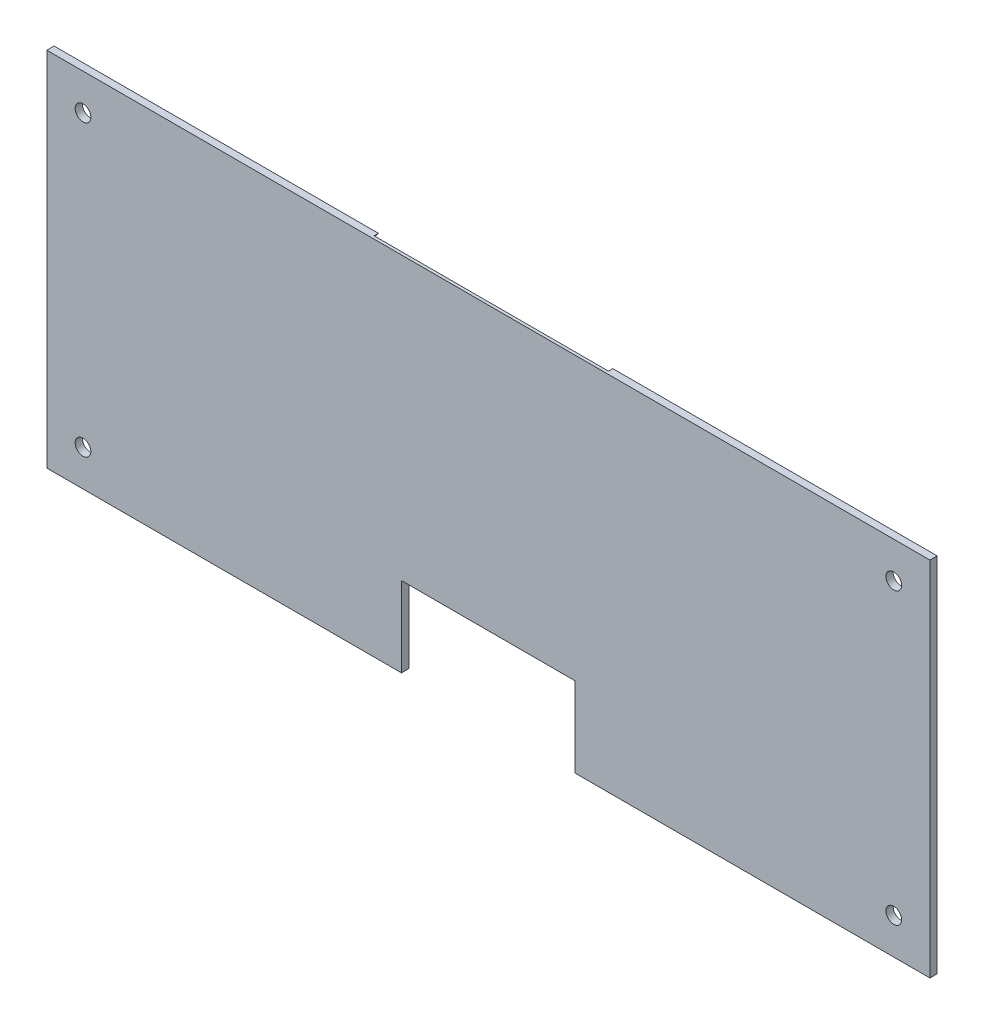
ISO-10303-21;
HEADER;
FILE_DESCRIPTION(('STEP AP214'),'2;1');
FILE_NAME('part.step','',(''),(''),'','','');
FILE_SCHEMA(('AUTOMOTIVE_DESIGN { 1 0 10303 214 1 1 1 1 }'));
ENDSEC;
DATA;
#1=APPLICATION_CONTEXT('core data for automotive mechanical design processes');
#2=APPLICATION_PROTOCOL_DEFINITION('international standard','automotive_design',2000,#1);
#3=PRODUCT_CONTEXT('',#1,'mechanical');
#4=PRODUCT('Part','Part','',(#3));
#5=PRODUCT_RELATED_PRODUCT_CATEGORY('part','',(#4));
#6=PRODUCT_DEFINITION_FORMATION('','',#4);
#7=PRODUCT_DEFINITION_CONTEXT('part definition',#1,'design');
#8=PRODUCT_DEFINITION('design','',#6,#7);
#9=PRODUCT_DEFINITION_SHAPE('','',#8);
#10=(LENGTH_UNIT() NAMED_UNIT(*) SI_UNIT(.MILLI.,.METRE.));
#11=(NAMED_UNIT(*) PLANE_ANGLE_UNIT() SI_UNIT($,.RADIAN.));
#12=(NAMED_UNIT(*) SI_UNIT($,.STERADIAN.) SOLID_ANGLE_UNIT());
#13=UNCERTAINTY_MEASURE_WITH_UNIT(LENGTH_MEASURE(1.E-05),#10,'distance_accuracy_value','');
#14=(GEOMETRIC_REPRESENTATION_CONTEXT(3) GLOBAL_UNCERTAINTY_ASSIGNED_CONTEXT((#13)) GLOBAL_UNIT_ASSIGNED_CONTEXT((#10,
#11,#12)) REPRESENTATION_CONTEXT('',''));
#15=CARTESIAN_POINT('',(0.,0.,0.));
#16=DIRECTION('',(0.,0.,1.));
#17=DIRECTION('',(1.,0.,0.));
#18=AXIS2_PLACEMENT_3D('',#15,#16,#17);
#19=CARTESIAN_POINT('',(0.,0.,3.175));
#20=DIRECTION('',(0.,0.,1.));
#21=DIRECTION('',(1.,0.,0.));
#22=AXIS2_PLACEMENT_3D('',#19,#20,#21);
#23=PLANE('',#22);
#24=CARTESIAN_POINT('',(177.8,-63.5,3.175));
#25=DIRECTION('',(0.,0.,1.));
#26=DIRECTION('',(1.,0.,0.));
#27=AXIS2_PLACEMENT_3D('',#24,#25,#26);
#28=CIRCLE('',#27,3.429);
#29=CARTESIAN_POINT('',(181.229,-63.5,3.175));
#30=VERTEX_POINT('',#29);
#31=EDGE_CURVE('E201',#30,#30,#28,.T.);
#32=ORIENTED_EDGE('',*,*,#31,.F.);
#33=EDGE_LOOP('',(#32));
#34=FACE_BOUND('',#33,.T.);
#35=CARTESIAN_POINT('',(-177.8,63.5,3.175));
#36=DIRECTION('',(0.,0.,1.));
#37=DIRECTION('',(1.,0.,0.));
#38=AXIS2_PLACEMENT_3D('',#35,#36,#37);
#39=CIRCLE('',#38,3.429);
#40=CARTESIAN_POINT('',(-174.371,63.5,3.175));
#41=VERTEX_POINT('',#40);
#42=EDGE_CURVE('E145',#41,#41,#39,.T.);
#43=ORIENTED_EDGE('',*,*,#42,.F.);
#44=EDGE_LOOP('',(#43));
#45=FACE_BOUND('',#44,.T.);
#46=DIRECTION('',(0.,-1.,0.));
#47=VECTOR('',#46,1.);
#48=CARTESIAN_POINT('',(-193.675,79.375,3.175));
#49=LINE('',#48,#47);
#50=CARTESIAN_POINT('',(-193.675,79.375,3.175));
#51=VERTEX_POINT('',#50);
#52=CARTESIAN_POINT('',(-193.675,-79.375,3.175));
#53=VERTEX_POINT('',#52);
#54=EDGE_CURVE('E159',#51,#53,#49,.T.);
#55=ORIENTED_EDGE('',*,*,#54,.T.);
#56=DIRECTION('',(1.,0.,0.));
#57=VECTOR('',#56,1.);
#58=CARTESIAN_POINT('',(-193.675,-79.375,3.175));
#59=LINE('',#58,#57);
#60=CARTESIAN_POINT('',(-38.1,-79.375,3.175));
#61=VERTEX_POINT('',#60);
#62=EDGE_CURVE('E97',#53,#61,#59,.T.);
#63=ORIENTED_EDGE('',*,*,#62,.T.);
#64=DIRECTION('',(0.,1.,0.));
#65=VECTOR('',#64,1.);
#66=CARTESIAN_POINT('',(-38.1,-79.375,3.175));
#67=LINE('',#66,#65);
#68=CARTESIAN_POINT('',(-38.1,-44.323,3.175));
#69=VERTEX_POINT('',#68);
#70=EDGE_CURVE('E219',#61,#69,#67,.T.);
#71=ORIENTED_EDGE('',*,*,#70,.T.);
#72=DIRECTION('',(1.,0.,0.));
#73=VECTOR('',#72,1.);
#74=CARTESIAN_POINT('',(-38.1,-44.323,3.175));
#75=LINE('',#74,#73);
#76=CARTESIAN_POINT('',(38.1,-44.323,3.175));
#77=VERTEX_POINT('',#76);
#78=EDGE_CURVE('E221',#69,#77,#75,.T.);
#79=ORIENTED_EDGE('',*,*,#78,.T.);
#80=DIRECTION('',(0.,-1.,0.));
#81=VECTOR('',#80,1.);
#82=CARTESIAN_POINT('',(38.1,-79.375,3.175));
#83=LINE('',#82,#81);
#84=CARTESIAN_POINT('',(38.1,-79.375,3.175));
#85=VERTEX_POINT('',#84);
#86=EDGE_CURVE('E119',#77,#85,#83,.T.);
#87=ORIENTED_EDGE('',*,*,#86,.T.);
#88=DIRECTION('',(1.,0.,0.));
#89=VECTOR('',#88,1.);
#90=CARTESIAN_POINT('',(38.1,-79.375,3.175));
#91=LINE('',#90,#89);
#92=CARTESIAN_POINT('',(193.675,-79.375,3.175));
#93=VERTEX_POINT('',#92);
#94=EDGE_CURVE('E112',#85,#93,#91,.T.);
#95=ORIENTED_EDGE('',*,*,#94,.T.);
#96=DIRECTION('',(0.,1.,0.));
#97=VECTOR('',#96,1.);
#98=CARTESIAN_POINT('',(193.675,79.375,3.175));
#99=LINE('',#98,#97);
#100=CARTESIAN_POINT('',(193.675,79.375,3.175));
#101=VERTEX_POINT('',#100);
#102=EDGE_CURVE('E116',#93,#101,#99,.T.);
#103=ORIENTED_EDGE('',*,*,#102,.T.);
#104=DIRECTION('',(-1.,0.,0.));
#105=VECTOR('',#104,1.);
#106=CARTESIAN_POINT('',(-193.675,79.375,3.175));
#107=LINE('',#106,#105);
#108=EDGE_CURVE('E56',#101,#51,#107,.T.);
#109=ORIENTED_EDGE('',*,*,#108,.T.);
#110=EDGE_LOOP('',(#55,#63,#71,#79,#87,#95,#103,#109));
#111=FACE_BOUND('',#110,.T.);
#112=CARTESIAN_POINT('',(177.8,63.5,3.175));
#113=DIRECTION('',(0.,0.,1.));
#114=DIRECTION('',(-1.,0.,0.));
#115=AXIS2_PLACEMENT_3D('',#112,#113,#114);
#116=CIRCLE('',#115,3.429);
#117=CARTESIAN_POINT('',(174.371,63.5,3.175));
#118=VERTEX_POINT('',#117);
#119=EDGE_CURVE('E207',#118,#118,#116,.T.);
#120=ORIENTED_EDGE('',*,*,#119,.F.);
#121=EDGE_LOOP('',(#120));
#122=FACE_BOUND('',#121,.T.);
#123=CARTESIAN_POINT('',(-177.8,-63.5,3.175));
#124=DIRECTION('',(0.,0.,1.));
#125=DIRECTION('',(-1.,0.,0.));
#126=AXIS2_PLACEMENT_3D('',#123,#124,#125);
#127=CIRCLE('',#126,3.429);
#128=CARTESIAN_POINT('',(-181.229,-63.5,3.175));
#129=VERTEX_POINT('',#128);
#130=EDGE_CURVE('E195',#129,#129,#127,.T.);
#131=ORIENTED_EDGE('',*,*,#130,.F.);
#132=EDGE_LOOP('',(#131));
#133=FACE_BOUND('',#132,.T.);
#134=ADVANCED_FACE('F33',(#34,#45,#111,#122,#133),#23,.T.);
#135=CARTESIAN_POINT('',(0.,0.,0.));
#136=DIRECTION('',(0.,0.,1.));
#137=DIRECTION('',(1.,0.,0.));
#138=AXIS2_PLACEMENT_3D('',#135,#136,#137);
#139=PLANE('',#138);
#140=CARTESIAN_POINT('',(177.8,-63.5,0.));
#141=DIRECTION('',(0.,0.,1.));
#142=DIRECTION('',(1.,0.,0.));
#143=AXIS2_PLACEMENT_3D('',#140,#141,#142);
#144=CIRCLE('',#143,3.429);
#145=CARTESIAN_POINT('',(181.229,-63.5,0.));
#146=VERTEX_POINT('',#145);
#147=EDGE_CURVE('E198',#146,#146,#144,.T.);
#148=ORIENTED_EDGE('',*,*,#147,.T.);
#149=EDGE_LOOP('',(#148));
#150=FACE_BOUND('',#149,.T.);
#151=CARTESIAN_POINT('',(-177.8,63.5,0.));
#152=DIRECTION('',(0.,0.,1.));
#153=DIRECTION('',(1.,0.,0.));
#154=AXIS2_PLACEMENT_3D('',#151,#152,#153);
#155=CIRCLE('',#154,3.429);
#156=CARTESIAN_POINT('',(-174.371,63.5,0.));
#157=VERTEX_POINT('',#156);
#158=EDGE_CURVE('E210',#157,#157,#155,.T.);
#159=ORIENTED_EDGE('',*,*,#158,.T.);
#160=EDGE_LOOP('',(#159));
#161=FACE_BOUND('',#160,.T.);
#162=DIRECTION('',(-1.,0.,0.));
#163=VECTOR('',#162,1.);
#164=CARTESIAN_POINT('',(-193.675,79.375,0.));
#165=LINE('',#164,#163);
#166=CARTESIAN_POINT('',(-51.3879414357104,79.375,0.));
#167=VERTEX_POINT('',#166);
#168=CARTESIAN_POINT('',(-193.675,79.375,0.));
#169=VERTEX_POINT('',#168);
#170=EDGE_CURVE('E88',#167,#169,#165,.T.);
#171=ORIENTED_EDGE('',*,*,#170,.F.);
#172=CARTESIAN_POINT('',(0.,34.925,0.));
#173=DIRECTION('',(0.,0.,-1.));
#174=DIRECTION('',(-1.,0.,0.));
#175=AXIS2_PLACEMENT_3D('',#172,#173,#174);
#176=CIRCLE('',#175,67.945);
#177=CARTESIAN_POINT('',(51.3879414357104,79.375,0.));
#178=VERTEX_POINT('',#177);
#179=EDGE_CURVE('E186',#178,#167,#176,.T.);
#180=ORIENTED_EDGE('',*,*,#179,.F.);
#181=CARTESIAN_POINT('',(193.675,79.375,0.));
#182=VERTEX_POINT('',#181);
#183=EDGE_CURVE('E156',#182,#178,#165,.T.);
#184=ORIENTED_EDGE('',*,*,#183,.F.);
#185=DIRECTION('',(0.,1.,0.));
#186=VECTOR('',#185,1.);
#187=CARTESIAN_POINT('',(193.675,79.375,0.));
#188=LINE('',#187,#186);
#189=CARTESIAN_POINT('',(193.675,-79.375,0.));
#190=VERTEX_POINT('',#189);
#191=EDGE_CURVE('E154',#190,#182,#188,.T.);
#192=ORIENTED_EDGE('',*,*,#191,.F.);
#193=DIRECTION('',(1.,0.,0.));
#194=VECTOR('',#193,1.);
#195=CARTESIAN_POINT('',(38.1,-79.375,0.));
#196=LINE('',#195,#194);
#197=CARTESIAN_POINT('',(38.1,-79.375,0.));
#198=VERTEX_POINT('',#197);
#199=EDGE_CURVE('E128',#198,#190,#196,.T.);
#200=ORIENTED_EDGE('',*,*,#199,.F.);
#201=DIRECTION('',(0.,-1.,0.));
#202=VECTOR('',#201,1.);
#203=CARTESIAN_POINT('',(38.1,-79.375,0.));
#204=LINE('',#203,#202);
#205=CARTESIAN_POINT('',(38.1,-44.323,0.));
#206=VERTEX_POINT('',#205);
#207=EDGE_CURVE('E151',#206,#198,#204,.T.);
#208=ORIENTED_EDGE('',*,*,#207,.F.);
#209=DIRECTION('',(1.,0.,0.));
#210=VECTOR('',#209,1.);
#211=CARTESIAN_POINT('',(-38.1,-44.323,0.));
#212=LINE('',#211,#210);
#213=CARTESIAN_POINT('',(-38.1,-44.323,0.));
#214=VERTEX_POINT('',#213);
#215=EDGE_CURVE('E149',#214,#206,#212,.T.);
#216=ORIENTED_EDGE('',*,*,#215,.F.);
#217=DIRECTION('',(0.,1.,0.));
#218=VECTOR('',#217,1.);
#219=CARTESIAN_POINT('',(-38.1,-79.375,0.));
#220=LINE('',#219,#218);
#221=CARTESIAN_POINT('',(-38.1,-79.375,0.));
#222=VERTEX_POINT('',#221);
#223=EDGE_CURVE('E147',#222,#214,#220,.T.);
#224=ORIENTED_EDGE('',*,*,#223,.F.);
#225=DIRECTION('',(1.,0.,0.));
#226=VECTOR('',#225,1.);
#227=CARTESIAN_POINT('',(-193.675,-79.375,0.));
#228=LINE('',#227,#226);
#229=CARTESIAN_POINT('',(-193.675,-79.375,0.));
#230=VERTEX_POINT('',#229);
#231=EDGE_CURVE('E144',#230,#222,#228,.T.);
#232=ORIENTED_EDGE('',*,*,#231,.F.);
#233=DIRECTION('',(0.,-1.,0.));
#234=VECTOR('',#233,1.);
#235=CARTESIAN_POINT('',(-193.675,79.375,0.));
#236=LINE('',#235,#234);
#237=EDGE_CURVE('E141',#169,#230,#236,.T.);
#238=ORIENTED_EDGE('',*,*,#237,.F.);
#239=EDGE_LOOP('',(#171,#180,#184,#192,#200,#208,#216,#224,#232,#238));
#240=FACE_BOUND('',#239,.T.);
#241=CARTESIAN_POINT('',(177.8,63.5,0.));
#242=DIRECTION('',(0.,0.,1.));
#243=DIRECTION('',(-1.,0.,0.));
#244=AXIS2_PLACEMENT_3D('',#241,#242,#243);
#245=CIRCLE('',#244,3.429);
#246=CARTESIAN_POINT('',(174.371,63.5,0.));
#247=VERTEX_POINT('',#246);
#248=EDGE_CURVE('E204',#247,#247,#245,.T.);
#249=ORIENTED_EDGE('',*,*,#248,.T.);
#250=EDGE_LOOP('',(#249));
#251=FACE_BOUND('',#250,.T.);
#252=CARTESIAN_POINT('',(-177.8,-63.5,0.));
#253=DIRECTION('',(0.,0.,1.));
#254=DIRECTION('',(-1.,0.,0.));
#255=AXIS2_PLACEMENT_3D('',#252,#253,#254);
#256=CIRCLE('',#255,3.429);
#257=CARTESIAN_POINT('',(-181.229,-63.5,0.));
#258=VERTEX_POINT('',#257);
#259=EDGE_CURVE('E192',#258,#258,#256,.T.);
#260=ORIENTED_EDGE('',*,*,#259,.T.);
#261=EDGE_LOOP('',(#260));
#262=FACE_BOUND('',#261,.T.);
#263=ADVANCED_FACE('F188',(#150,#161,#240,#251,#262),#139,.F.);
#264=CARTESIAN_POINT('',(-193.675,79.375,3.175));
#265=DIRECTION('',(1.,0.,0.));
#266=DIRECTION('',(0.,0.,-1.));
#267=AXIS2_PLACEMENT_3D('',#264,#265,#266);
#268=PLANE('',#267);
#269=ORIENTED_EDGE('',*,*,#237,.T.);
#270=DIRECTION('',(0.,0.,-1.));
#271=VECTOR('',#270,1.);
#272=CARTESIAN_POINT('',(-193.675,-79.375,3.175));
#273=LINE('',#272,#271);
#274=EDGE_CURVE('E172',#53,#230,#273,.T.);
#275=ORIENTED_EDGE('',*,*,#274,.F.);
#276=ORIENTED_EDGE('',*,*,#54,.F.);
#277=DIRECTION('',(0.,0.,-1.));
#278=VECTOR('',#277,1.);
#279=CARTESIAN_POINT('',(-193.675,79.375,3.175));
#280=LINE('',#279,#278);
#281=EDGE_CURVE('E137',#51,#169,#280,.T.);
#282=ORIENTED_EDGE('',*,*,#281,.T.);
#283=EDGE_LOOP('',(#269,#275,#276,#282));
#284=FACE_BOUND('',#283,.T.);
#285=ADVANCED_FACE('F35',(#284),#268,.F.);
#286=CARTESIAN_POINT('',(-193.675,-79.375,3.175));
#287=DIRECTION('',(0.,1.,0.));
#288=DIRECTION('',(0.,0.,1.));
#289=AXIS2_PLACEMENT_3D('',#286,#287,#288);
#290=PLANE('',#289);
#291=ORIENTED_EDGE('',*,*,#231,.T.);
#292=DIRECTION('',(0.,0.,-1.));
#293=VECTOR('',#292,1.);
#294=CARTESIAN_POINT('',(-38.1,-79.375,3.175));
#295=LINE('',#294,#293);
#296=EDGE_CURVE('E169',#61,#222,#295,.T.);
#297=ORIENTED_EDGE('',*,*,#296,.F.);
#298=ORIENTED_EDGE('',*,*,#62,.F.);
#299=ORIENTED_EDGE('',*,*,#274,.T.);
#300=EDGE_LOOP('',(#291,#297,#298,#299));
#301=FACE_BOUND('',#300,.T.);
#302=ADVANCED_FACE('F235',(#301),#290,.F.);
#303=CARTESIAN_POINT('',(-38.1,-79.375,3.175));
#304=DIRECTION('',(-1.,0.,0.));
#305=DIRECTION('',(0.,0.,1.));
#306=AXIS2_PLACEMENT_3D('',#303,#304,#305);
#307=PLANE('',#306);
#308=ORIENTED_EDGE('',*,*,#223,.T.);
#309=DIRECTION('',(0.,0.,-1.));
#310=VECTOR('',#309,1.);
#311=CARTESIAN_POINT('',(-38.1,-44.323,3.175));
#312=LINE('',#311,#310);
#313=EDGE_CURVE('E166',#69,#214,#312,.T.);
#314=ORIENTED_EDGE('',*,*,#313,.F.);
#315=ORIENTED_EDGE('',*,*,#70,.F.);
#316=ORIENTED_EDGE('',*,*,#296,.T.);
#317=EDGE_LOOP('',(#308,#314,#315,#316));
#318=FACE_BOUND('',#317,.T.);
#319=ADVANCED_FACE('F238',(#318),#307,.F.);
#320=CARTESIAN_POINT('',(-38.1,-44.323,3.175));
#321=DIRECTION('',(0.,1.,0.));
#322=DIRECTION('',(0.,0.,1.));
#323=AXIS2_PLACEMENT_3D('',#320,#321,#322);
#324=PLANE('',#323);
#325=ORIENTED_EDGE('',*,*,#215,.T.);
#326=DIRECTION('',(0.,0.,-1.));
#327=VECTOR('',#326,1.);
#328=CARTESIAN_POINT('',(38.1,-44.323,3.175));
#329=LINE('',#328,#327);
#330=EDGE_CURVE('E163',#77,#206,#329,.T.);
#331=ORIENTED_EDGE('',*,*,#330,.F.);
#332=ORIENTED_EDGE('',*,*,#78,.F.);
#333=ORIENTED_EDGE('',*,*,#313,.T.);
#334=EDGE_LOOP('',(#325,#331,#332,#333));
#335=FACE_BOUND('',#334,.T.);
#336=ADVANCED_FACE('F227',(#335),#324,.F.);
#337=CARTESIAN_POINT('',(38.1,-79.375,3.175));
#338=DIRECTION('',(1.,0.,0.));
#339=DIRECTION('',(0.,1.,0.));
#340=AXIS2_PLACEMENT_3D('',#337,#338,#339);
#341=PLANE('',#340);
#342=ORIENTED_EDGE('',*,*,#207,.T.);
#343=DIRECTION('',(0.,0.,-1.));
#344=VECTOR('',#343,1.);
#345=CARTESIAN_POINT('',(38.1,-79.375,3.175));
#346=LINE('',#345,#344);
#347=EDGE_CURVE('E131',#85,#198,#346,.T.);
#348=ORIENTED_EDGE('',*,*,#347,.F.);
#349=ORIENTED_EDGE('',*,*,#86,.F.);
#350=ORIENTED_EDGE('',*,*,#330,.T.);
#351=EDGE_LOOP('',(#342,#348,#349,#350));
#352=FACE_BOUND('',#351,.T.);
#353=ADVANCED_FACE('F231',(#352),#341,.F.);
#354=CARTESIAN_POINT('',(38.1,-79.375,3.175));
#355=DIRECTION('',(0.,1.,0.));
#356=DIRECTION('',(-1.,0.,0.));
#357=AXIS2_PLACEMENT_3D('',#354,#355,#356);
#358=PLANE('',#357);
#359=ORIENTED_EDGE('',*,*,#199,.T.);
#360=DIRECTION('',(0.,0.,-1.));
#361=VECTOR('',#360,1.);
#362=CARTESIAN_POINT('',(193.675,-79.375,3.175));
#363=LINE('',#362,#361);
#364=EDGE_CURVE('E125',#93,#190,#363,.T.);
#365=ORIENTED_EDGE('',*,*,#364,.F.);
#366=ORIENTED_EDGE('',*,*,#94,.F.);
#367=ORIENTED_EDGE('',*,*,#347,.T.);
#368=EDGE_LOOP('',(#359,#365,#366,#367));
#369=FACE_BOUND('',#368,.T.);
#370=ADVANCED_FACE('F126',(#369),#358,.F.);
#371=CARTESIAN_POINT('',(193.675,79.375,3.175));
#372=DIRECTION('',(-1.,0.,0.));
#373=DIRECTION('',(0.,0.,1.));
#374=AXIS2_PLACEMENT_3D('',#371,#372,#373);
#375=PLANE('',#374);
#376=ORIENTED_EDGE('',*,*,#191,.T.);
#377=DIRECTION('',(0.,0.,-1.));
#378=VECTOR('',#377,1.);
#379=CARTESIAN_POINT('',(193.675,79.375,3.175));
#380=LINE('',#379,#378);
#381=EDGE_CURVE('E132',#101,#182,#380,.T.);
#382=ORIENTED_EDGE('',*,*,#381,.F.);
#383=ORIENTED_EDGE('',*,*,#102,.F.);
#384=ORIENTED_EDGE('',*,*,#364,.T.);
#385=EDGE_LOOP('',(#376,#382,#383,#384));
#386=FACE_BOUND('',#385,.T.);
#387=ADVANCED_FACE('F134',(#386),#375,.F.);
#388=CARTESIAN_POINT('',(-193.675,79.375,3.175));
#389=DIRECTION('',(0.,-1.,0.));
#390=DIRECTION('',(0.,0.,-1.));
#391=AXIS2_PLACEMENT_3D('',#388,#389,#390);
#392=PLANE('',#391);
#393=DIRECTION('',(1.,0.,0.));
#394=VECTOR('',#393,1.);
#395=CARTESIAN_POINT('',(-193.675,79.375,1.905));
#396=LINE('',#395,#394);
#397=CARTESIAN_POINT('',(-51.3879414357104,79.375,1.905));
#398=VERTEX_POINT('',#397);
#399=CARTESIAN_POINT('',(51.3879414357104,79.375,1.905));
#400=VERTEX_POINT('',#399);
#401=EDGE_CURVE('E174',#398,#400,#396,.T.);
#402=ORIENTED_EDGE('',*,*,#401,.F.);
#403=DIRECTION('',(0.,0.,-1.));
#404=VECTOR('',#403,1.);
#405=CARTESIAN_POINT('',(-51.3879414357104,79.375,1.905));
#406=LINE('',#405,#404);
#407=EDGE_CURVE('E11',#398,#167,#406,.T.);
#408=ORIENTED_EDGE('',*,*,#407,.T.);
#409=ORIENTED_EDGE('',*,*,#170,.T.);
#410=ORIENTED_EDGE('',*,*,#281,.F.);
#411=ORIENTED_EDGE('',*,*,#108,.F.);
#412=ORIENTED_EDGE('',*,*,#381,.T.);
#413=ORIENTED_EDGE('',*,*,#183,.T.);
#414=DIRECTION('',(0.,0.,-1.));
#415=VECTOR('',#414,1.);
#416=CARTESIAN_POINT('',(51.3879414357104,79.375,1.905));
#417=LINE('',#416,#415);
#418=EDGE_CURVE('E41',#178,#400,#417,.F.);
#419=ORIENTED_EDGE('',*,*,#418,.T.);
#420=EDGE_LOOP('',(#402,#408,#409,#410,#411,#412,#413,#419));
#421=FACE_BOUND('',#420,.T.);
#422=ADVANCED_FACE('F178',(#421),#392,.F.);
#423=CARTESIAN_POINT('',(-177.8,63.5,3.175));
#424=DIRECTION('',(0.,0.,-1.));
#425=DIRECTION('',(-1.,0.,0.));
#426=AXIS2_PLACEMENT_3D('',#423,#424,#425);
#427=CYLINDRICAL_SURFACE('',#426,3.429);
#428=ORIENTED_EDGE('',*,*,#42,.T.);
#429=EDGE_LOOP('',(#428));
#430=FACE_BOUND('',#429,.T.);
#431=ORIENTED_EDGE('',*,*,#158,.F.);
#432=EDGE_LOOP('',(#431));
#433=FACE_BOUND('',#432,.T.);
#434=ADVANCED_FACE('F257',(#430,#433),#427,.F.);
#435=CARTESIAN_POINT('',(177.8,63.5,3.175));
#436=DIRECTION('',(0.,0.,-1.));
#437=DIRECTION('',(-1.,0.,0.));
#438=AXIS2_PLACEMENT_3D('',#435,#436,#437);
#439=CYLINDRICAL_SURFACE('',#438,3.429);
#440=ORIENTED_EDGE('',*,*,#119,.T.);
#441=EDGE_LOOP('',(#440));
#442=FACE_BOUND('',#441,.T.);
#443=ORIENTED_EDGE('',*,*,#248,.F.);
#444=EDGE_LOOP('',(#443));
#445=FACE_BOUND('',#444,.T.);
#446=ADVANCED_FACE('F291',(#442,#445),#439,.F.);
#447=CARTESIAN_POINT('',(177.8,-63.5,3.175));
#448=DIRECTION('',(0.,0.,-1.));
#449=DIRECTION('',(-1.,0.,0.));
#450=AXIS2_PLACEMENT_3D('',#447,#448,#449);
#451=CYLINDRICAL_SURFACE('',#450,3.429);
#452=ORIENTED_EDGE('',*,*,#31,.T.);
#453=EDGE_LOOP('',(#452));
#454=FACE_BOUND('',#453,.T.);
#455=ORIENTED_EDGE('',*,*,#147,.F.);
#456=EDGE_LOOP('',(#455));
#457=FACE_BOUND('',#456,.T.);
#458=ADVANCED_FACE('F298',(#454,#457),#451,.F.);
#459=CARTESIAN_POINT('',(-177.8,-63.5,3.175));
#460=DIRECTION('',(0.,0.,-1.));
#461=DIRECTION('',(-1.,0.,0.));
#462=AXIS2_PLACEMENT_3D('',#459,#460,#461);
#463=CYLINDRICAL_SURFACE('',#462,3.429);
#464=ORIENTED_EDGE('',*,*,#130,.T.);
#465=EDGE_LOOP('',(#464));
#466=FACE_BOUND('',#465,.T.);
#467=ORIENTED_EDGE('',*,*,#259,.F.);
#468=EDGE_LOOP('',(#467));
#469=FACE_BOUND('',#468,.T.);
#470=ADVANCED_FACE('F305',(#466,#469),#463,.F.);
#471=CARTESIAN_POINT('',(0.,34.925,1.905));
#472=DIRECTION('',(0.,0.,-1.));
#473=DIRECTION('',(-1.,0.,0.));
#474=AXIS2_PLACEMENT_3D('',#471,#472,#473);
#475=CYLINDRICAL_SURFACE('',#474,67.945);
#476=CARTESIAN_POINT('',(0.,34.925,1.905));
#477=DIRECTION('',(0.,0.,-1.));
#478=DIRECTION('',(-1.,0.,0.));
#479=AXIS2_PLACEMENT_3D('',#476,#477,#478);
#480=CIRCLE('',#479,67.945);
#481=EDGE_CURVE('E47',#400,#398,#480,.T.);
#482=ORIENTED_EDGE('',*,*,#481,.F.);
#483=ORIENTED_EDGE('',*,*,#418,.F.);
#484=ORIENTED_EDGE('',*,*,#179,.T.);
#485=ORIENTED_EDGE('',*,*,#407,.F.);
#486=EDGE_LOOP('',(#482,#483,#484,#485));
#487=FACE_BOUND('',#486,.T.);
#488=ADVANCED_FACE('F184',(#487),#475,.F.);
#489=CARTESIAN_POINT('',(0.,34.925,1.905));
#490=DIRECTION('',(0.,0.,-1.));
#491=DIRECTION('',(-1.,0.,0.));
#492=AXIS2_PLACEMENT_3D('',#489,#490,#491);
#493=PLANE('',#492);
#494=ORIENTED_EDGE('',*,*,#401,.T.);
#495=ORIENTED_EDGE('',*,*,#481,.T.);
#496=EDGE_LOOP('',(#494,#495));
#497=FACE_BOUND('',#496,.T.);
#498=ADVANCED_FACE('F319',(#497),#493,.T.);
#499=CLOSED_SHELL('',(#134,#263,#285,#302,#319,#336,#353,#370,#387,#422,#434,#446,#458,#470,
#488,#498));
#500=MANIFOLD_SOLID_BREP('B2',#499);
#501=ADVANCED_BREP_SHAPE_REPRESENTATION('',(#18,#500),#14);
#502=SHAPE_DEFINITION_REPRESENTATION(#9,#501);
ENDSEC;
END-ISO-10303-21;
